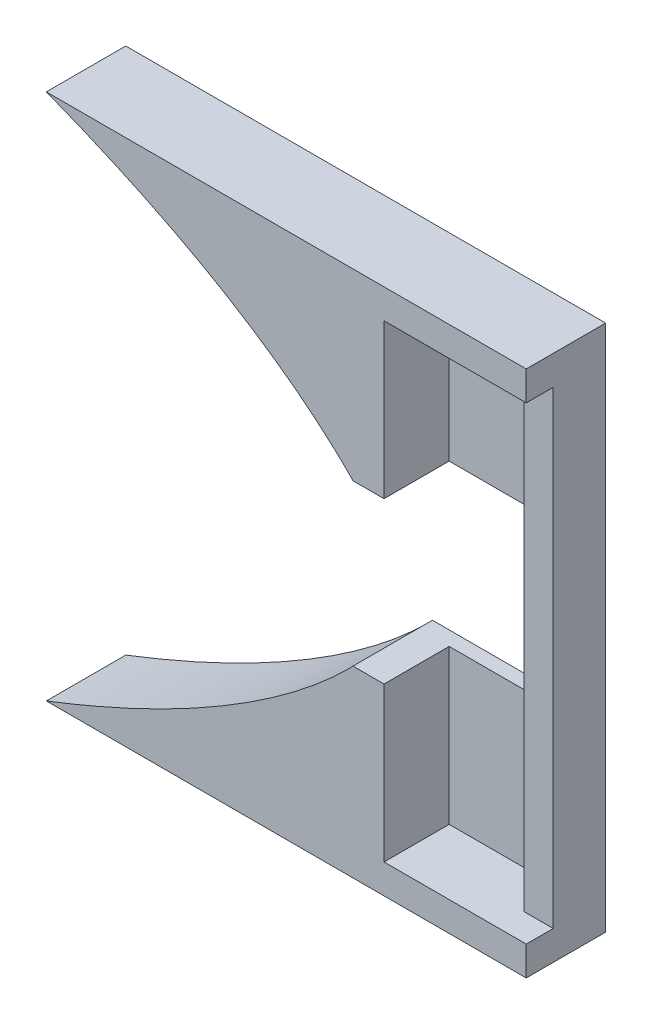
ISO-10303-21;
HEADER;
FILE_DESCRIPTION(('STEP AP214'),'2;1');
FILE_NAME('part.step','',(''),(''),'','','');
FILE_SCHEMA(('AUTOMOTIVE_DESIGN { 1 0 10303 214 1 1 1 1 }'));
ENDSEC;
DATA;
#1=APPLICATION_CONTEXT('core data for automotive mechanical design processes');
#2=APPLICATION_PROTOCOL_DEFINITION('international standard','automotive_design',2000,#1);
#3=PRODUCT_CONTEXT('',#1,'mechanical');
#4=PRODUCT('Part','Part','',(#3));
#5=PRODUCT_RELATED_PRODUCT_CATEGORY('part','',(#4));
#6=PRODUCT_DEFINITION_FORMATION('','',#4);
#7=PRODUCT_DEFINITION_CONTEXT('part definition',#1,'design');
#8=PRODUCT_DEFINITION('design','',#6,#7);
#9=PRODUCT_DEFINITION_SHAPE('','',#8);
#10=(LENGTH_UNIT() NAMED_UNIT(*) SI_UNIT(.MILLI.,.METRE.));
#11=(NAMED_UNIT(*) PLANE_ANGLE_UNIT() SI_UNIT($,.RADIAN.));
#12=(NAMED_UNIT(*) SI_UNIT($,.STERADIAN.) SOLID_ANGLE_UNIT());
#13=UNCERTAINTY_MEASURE_WITH_UNIT(LENGTH_MEASURE(1.E-05),#10,'distance_accuracy_value','');
#14=(GEOMETRIC_REPRESENTATION_CONTEXT(3) GLOBAL_UNCERTAINTY_ASSIGNED_CONTEXT((#13)) GLOBAL_UNIT_ASSIGNED_CONTEXT((#10,
#11,#12)) REPRESENTATION_CONTEXT('',''));
#15=CARTESIAN_POINT('',(0.,0.,0.));
#16=DIRECTION('',(0.,0.,1.));
#17=DIRECTION('',(1.,0.,0.));
#18=AXIS2_PLACEMENT_3D('',#15,#16,#17);
#19=CARTESIAN_POINT('',(0.,0.,0.));
#20=DIRECTION('',(0.,0.,1.));
#21=DIRECTION('',(1.,0.,0.));
#22=AXIS2_PLACEMENT_3D('',#19,#20,#21);
#23=PLANE('',#22);
#24=DIRECTION('',(0.,1.,0.));
#25=VECTOR('',#24,1.);
#26=CARTESIAN_POINT('',(64.8500000000002,0.,0.));
#27=LINE('',#26,#25);
#28=CARTESIAN_POINT('',(64.8500000000002,-14.7500000000006,0.));
#29=VERTEX_POINT('',#28);
#30=CARTESIAN_POINT('',(64.8500000000002,14.7499999999994,0.));
#31=VERTEX_POINT('',#30);
#32=EDGE_CURVE('E54',#29,#31,#27,.T.);
#33=ORIENTED_EDGE('',*,*,#32,.T.);
#34=DIRECTION('',(1.,0.,0.));
#35=VECTOR('',#34,1.);
#36=CARTESIAN_POINT('',(1.54964558399759E-13,14.75,0.));
#37=LINE('',#36,#35);
#38=CARTESIAN_POINT('',(63.0000000000002,14.7499999999993,0.));
#39=VERTEX_POINT('',#38);
#40=EDGE_CURVE('E199',#39,#31,#37,.T.);
#41=ORIENTED_EDGE('',*,*,#40,.F.);
#42=DIRECTION('',(0.,1.,0.));
#43=VECTOR('',#42,1.);
#44=CARTESIAN_POINT('',(63.,-6.81658119780446E-13,0.));
#45=LINE('',#44,#43);
#46=CARTESIAN_POINT('',(63.,-14.7500000000007,0.));
#47=VERTEX_POINT('',#46);
#48=EDGE_CURVE('E273',#47,#39,#45,.T.);
#49=ORIENTED_EDGE('',*,*,#48,.F.);
#50=DIRECTION('',(1.,0.,0.));
#51=VECTOR('',#50,1.);
#52=CARTESIAN_POINT('',(0.,-14.7500000000007,0.));
#53=LINE('',#52,#51);
#54=EDGE_CURVE('E12',#47,#29,#53,.T.);
#55=ORIENTED_EDGE('',*,*,#54,.T.);
#56=EDGE_LOOP('',(#33,#41,#49,#55));
#57=FACE_BOUND('',#56,.T.);
#58=ADVANCED_FACE('F37',(#57),#23,.T.);
#59=CARTESIAN_POINT('',(55.9,-5.99820880250125E-13,-3.3));
#60=DIRECTION('',(-1.,0.,0.));
#61=DIRECTION('',(0.,-1.,0.));
#62=AXIS2_PLACEMENT_3D('',#59,#60,#61);
#63=PLANE('',#62);
#64=DIRECTION('',(0.,1.,0.));
#65=VECTOR('',#64,1.);
#66=CARTESIAN_POINT('',(55.8999999999998,-14.7500000000006,-2.4));
#67=LINE('',#66,#65);
#68=CARTESIAN_POINT('',(55.8999999999998,-14.7500000000006,-2.4));
#69=VERTEX_POINT('',#68);
#70=CARTESIAN_POINT('',(55.8999999999998,-5.05000000000059,-2.4));
#71=VERTEX_POINT('',#70);
#72=EDGE_CURVE('E252',#69,#71,#67,.T.);
#73=ORIENTED_EDGE('',*,*,#72,.T.);
#74=DIRECTION('',(0.,0.,1.));
#75=VECTOR('',#74,1.);
#76=CARTESIAN_POINT('',(55.8999999999999,-5.05000000000059,-3.3));
#77=LINE('',#76,#75);
#78=CARTESIAN_POINT('',(55.8999999999999,-5.05000000000059,1.7));
#79=VERTEX_POINT('',#78);
#80=EDGE_CURVE('E389',#71,#79,#77,.T.);
#81=ORIENTED_EDGE('',*,*,#80,.T.);
#82=DIRECTION('',(0.,1.,0.));
#83=VECTOR('',#82,1.);
#84=CARTESIAN_POINT('',(55.9,-5.99820880250125E-13,1.7));
#85=LINE('',#84,#83);
#86=CARTESIAN_POINT('',(55.8999999999998,-14.7500000000006,1.7));
#87=VERTEX_POINT('',#86);
#88=EDGE_CURVE('E234',#87,#79,#85,.T.);
#89=ORIENTED_EDGE('',*,*,#88,.F.);
#90=DIRECTION('',(0.,0.,1.));
#91=VECTOR('',#90,1.);
#92=CARTESIAN_POINT('',(55.8999999999998,-14.7500000000006,-3.3));
#93=LINE('',#92,#91);
#94=EDGE_CURVE('E391',#69,#87,#93,.T.);
#95=ORIENTED_EDGE('',*,*,#94,.F.);
#96=EDGE_LOOP('',(#73,#81,#89,#95));
#97=FACE_BOUND('',#96,.T.);
#98=ADVANCED_FACE('F320',(#97),#63,.F.);
#99=CARTESIAN_POINT('',(-1.69379866157876E-13,-14.7499999999999,-3.3));
#100=DIRECTION('',(0.,-1.,0.));
#101=DIRECTION('',(1.,0.,0.));
#102=AXIS2_PLACEMENT_3D('',#99,#100,#101);
#103=PLANE('',#102);
#104=DIRECTION('',(-1.,0.,0.));
#105=VECTOR('',#104,1.);
#106=CARTESIAN_POINT('',(55.8999999999998,-14.7500000000006,-2.4));
#107=LINE('',#106,#105);
#108=CARTESIAN_POINT('',(63.,-14.7500000000006,-2.4));
#109=VERTEX_POINT('',#108);
#110=EDGE_CURVE('E261',#109,#69,#107,.T.);
#111=ORIENTED_EDGE('',*,*,#110,.T.);
#112=ORIENTED_EDGE('',*,*,#94,.T.);
#113=DIRECTION('',(1.,0.,0.));
#114=VECTOR('',#113,1.);
#115=CARTESIAN_POINT('',(0.,-14.7500000000007,1.7));
#116=LINE('',#115,#114);
#117=CARTESIAN_POINT('',(64.8500000000002,-14.7500000000007,1.7));
#118=VERTEX_POINT('',#117);
#119=EDGE_CURVE('E193',#87,#118,#116,.T.);
#120=ORIENTED_EDGE('',*,*,#119,.T.);
#121=DIRECTION('',(0.,0.,-1.));
#122=VECTOR('',#121,1.);
#123=CARTESIAN_POINT('',(64.8500000000002,-14.7500000000007,39.0381002635323));
#124=LINE('',#123,#122);
#125=EDGE_CURVE('E62',#118,#29,#124,.T.);
#126=ORIENTED_EDGE('',*,*,#125,.T.);
#127=ORIENTED_EDGE('',*,*,#54,.F.);
#128=DIRECTION('',(0.,0.,1.));
#129=VECTOR('',#128,1.);
#130=CARTESIAN_POINT('',(62.9999999999999,-14.7500000000007,-3.3));
#131=LINE('',#130,#129);
#132=EDGE_CURVE('E393',#109,#47,#131,.T.);
#133=ORIENTED_EDGE('',*,*,#132,.F.);
#134=EDGE_LOOP('',(#111,#112,#120,#126,#127,#133));
#135=FACE_BOUND('',#134,.T.);
#136=ADVANCED_FACE('F325',(#135),#103,.F.);
#137=CARTESIAN_POINT('',(0.,-24.,-3.3));
#138=CARTESIAN_POINT('',(10.9049465601111,-24.,-3.3));
#139=CARTESIAN_POINT('',(40.8426434536443,-18.1639582641541,-3.3));
#140=CARTESIAN_POINT('',(53.7033008588991,-5.30330085889908,-3.3));
#141=B_SPLINE_CURVE_WITH_KNOTS('',3,(#137,#138,#139,#140),.UNSPECIFIED.,.F.,.F.,(4,4),(0.,1.),.UNSPECIFIED.);
#142=DIRECTION('',(0.,0.,1.));
#143=VECTOR('',#142,1.);
#144=SURFACE_OF_LINEAR_EXTRUSION('',#141,#143);
#145=DIRECTION('',(0.,0.,1.));
#146=VECTOR('',#145,1.);
#147=CARTESIAN_POINT('',(34.6448642006982,-16.5999999999993,-3.3));
#148=LINE('',#147,#146);
#149=CARTESIAN_POINT('',(34.6448642006982,-16.5999999999993,-3.3));
#150=VERTEX_POINT('',#149);
#151=CARTESIAN_POINT('',(34.6448642006982,-16.5999999999993,1.7));
#152=VERTEX_POINT('',#151);
#153=EDGE_CURVE('E42',#150,#152,#148,.T.);
#154=ORIENTED_EDGE('',*,*,#153,.T.);
#155=CARTESIAN_POINT('',(53.7033008588991,-5.30330085889908,1.7));
#156=CARTESIAN_POINT('',(40.8426434536443,-18.1639582641541,1.7));
#157=CARTESIAN_POINT('',(10.9049465601111,-24.,1.7));
#158=CARTESIAN_POINT('',(0.,-24.,1.7));
#159=B_SPLINE_CURVE_WITH_KNOTS('',3,(#155,#156,#157,#158),.UNSPECIFIED.,.F.,.F.,(4,4),(0.,1.),.UNSPECIFIED.);
#160=CARTESIAN_POINT('',(53.7033008588991,-5.30330085889908,1.7));
#161=VERTEX_POINT('',#160);
#162=EDGE_CURVE('E220',#161,#152,#159,.T.);
#163=ORIENTED_EDGE('',*,*,#162,.F.);
#164=DIRECTION('',(0.,0.,1.));
#165=VECTOR('',#164,1.);
#166=CARTESIAN_POINT('',(53.7033008588991,-5.30330085889908,-3.3));
#167=LINE('',#166,#165);
#168=CARTESIAN_POINT('',(53.7033008588991,-5.30330085889908,-3.3));
#169=VERTEX_POINT('',#168);
#170=EDGE_CURVE('E47',#169,#161,#167,.T.);
#171=ORIENTED_EDGE('',*,*,#170,.F.);
#172=EDGE_CURVE('E266',#150,#169,#141,.T.);
#173=ORIENTED_EDGE('',*,*,#172,.F.);
#174=EDGE_LOOP('',(#154,#163,#171,#173));
#175=FACE_BOUND('',#174,.T.);
#176=ADVANCED_FACE('F39',(#175),#144,.F.);
#177=CARTESIAN_POINT('',(48.4,0.,-3.3));
#178=DIRECTION('',(0.,0.,1.));
#179=DIRECTION('',(1.,0.,0.));
#180=AXIS2_PLACEMENT_3D('',#177,#178,#179);
#181=CYLINDRICAL_SURFACE('',#180,7.5);
#182=ORIENTED_EDGE('',*,*,#170,.T.);
#183=CARTESIAN_POINT('',(48.4,0.,1.7));
#184=DIRECTION('',(0.,0.,1.));
#185=DIRECTION('',(1.,0.,0.));
#186=AXIS2_PLACEMENT_3D('',#183,#184,#185);
#187=CIRCLE('',#186,7.5);
#188=CARTESIAN_POINT('',(53.9450428312136,-5.05000000000064,1.7));
#189=VERTEX_POINT('',#188);
#190=EDGE_CURVE('E225',#189,#161,#187,.F.);
#191=ORIENTED_EDGE('',*,*,#190,.F.);
#192=DIRECTION('',(0.,0.,1.));
#193=VECTOR('',#192,1.);
#194=CARTESIAN_POINT('',(53.9450428312136,-5.05000000000064,-3.3));
#195=LINE('',#194,#193);
#196=CARTESIAN_POINT('',(53.9450428312136,-5.05000000000064,-3.3));
#197=VERTEX_POINT('',#196);
#198=EDGE_CURVE('E387',#197,#189,#195,.T.);
#199=ORIENTED_EDGE('',*,*,#198,.F.);
#200=CARTESIAN_POINT('',(48.4,0.,-3.3));
#201=DIRECTION('',(0.,0.,1.));
#202=DIRECTION('',(1.,0.,0.));
#203=AXIS2_PLACEMENT_3D('',#200,#201,#202);
#204=CIRCLE('',#203,7.5);
#205=EDGE_CURVE('E370',#169,#197,#204,.T.);
#206=ORIENTED_EDGE('',*,*,#205,.F.);
#207=EDGE_LOOP('',(#182,#191,#199,#206));
#208=FACE_BOUND('',#207,.T.);
#209=ADVANCED_FACE('F330',(#208),#181,.F.);
#210=CARTESIAN_POINT('',(1.25470728167153E-13,-5.05000000000198,-3.3));
#211=DIRECTION('',(0.,1.,0.));
#212=DIRECTION('',(-1.,0.,0.));
#213=AXIS2_PLACEMENT_3D('',#210,#211,#212);
#214=PLANE('',#213);
#215=ORIENTED_EDGE('',*,*,#198,.T.);
#216=DIRECTION('',(-1.,0.,0.));
#217=VECTOR('',#216,1.);
#218=CARTESIAN_POINT('',(1.25470728167153E-13,-5.05000000000198,1.7));
#219=LINE('',#218,#217);
#220=EDGE_CURVE('E231',#79,#189,#219,.T.);
#221=ORIENTED_EDGE('',*,*,#220,.F.);
#222=ORIENTED_EDGE('',*,*,#80,.F.);
#223=DIRECTION('',(1.,0.,0.));
#224=VECTOR('',#223,1.);
#225=CARTESIAN_POINT('',(55.8999999999998,-5.05000000000059,-2.4));
#226=LINE('',#225,#224);
#227=CARTESIAN_POINT('',(62.9999999999999,-5.05000000000059,-2.4));
#228=VERTEX_POINT('',#227);
#229=EDGE_CURVE('E255',#71,#228,#226,.T.);
#230=ORIENTED_EDGE('',*,*,#229,.T.);
#231=DIRECTION('',(0.,0.,-1.));
#232=VECTOR('',#231,1.);
#233=CARTESIAN_POINT('',(62.9999999999999,-5.05000000000059,-2.4));
#234=LINE('',#233,#232);
#235=CARTESIAN_POINT('',(63.,-5.05000000000059,-3.3));
#236=VERTEX_POINT('',#235);
#237=EDGE_CURVE('E264',#228,#236,#234,.T.);
#238=ORIENTED_EDGE('',*,*,#237,.T.);
#239=DIRECTION('',(-1.,0.,0.));
#240=VECTOR('',#239,1.);
#241=CARTESIAN_POINT('',(1.25470728167153E-13,-5.05000000000198,-3.3));
#242=LINE('',#241,#240);
#243=EDGE_CURVE('E374',#236,#197,#242,.T.);
#244=ORIENTED_EDGE('',*,*,#243,.T.);
#245=EDGE_LOOP('',(#215,#221,#222,#230,#238,#244));
#246=FACE_BOUND('',#245,.T.);
#247=ADVANCED_FACE('F333',(#246),#214,.T.);
#248=CARTESIAN_POINT('',(63.,-6.81658119780446E-13,-3.3));
#249=DIRECTION('',(1.,0.,0.));
#250=DIRECTION('',(0.,1.,0.));
#251=AXIS2_PLACEMENT_3D('',#248,#249,#250);
#252=PLANE('',#251);
#253=DIRECTION('',(0.,-1.,0.));
#254=VECTOR('',#253,1.);
#255=CARTESIAN_POINT('',(63.0000000000001,14.7499999999994,-2.4));
#256=LINE('',#255,#254);
#257=CARTESIAN_POINT('',(63.0000000000001,14.7499999999994,-2.4));
#258=VERTEX_POINT('',#257);
#259=CARTESIAN_POINT('',(62.9999999999999,5.04999999999941,-2.4));
#260=VERTEX_POINT('',#259);
#261=EDGE_CURVE('E245',#258,#260,#256,.T.);
#262=ORIENTED_EDGE('',*,*,#261,.T.);
#263=DIRECTION('',(0.,0.,-1.));
#264=VECTOR('',#263,1.);
#265=CARTESIAN_POINT('',(62.9999999999999,5.04999999999941,-2.4));
#266=LINE('',#265,#264);
#267=CARTESIAN_POINT('',(62.9999999999999,5.04999999999941,-3.3));
#268=VERTEX_POINT('',#267);
#269=EDGE_CURVE('E249',#260,#268,#266,.T.);
#270=ORIENTED_EDGE('',*,*,#269,.T.);
#271=DIRECTION('',(0.,1.,0.));
#272=VECTOR('',#271,1.);
#273=CARTESIAN_POINT('',(63.,-6.81658119780446E-13,-3.3));
#274=LINE('',#273,#272);
#275=EDGE_CURVE('E377',#236,#268,#274,.T.);
#276=ORIENTED_EDGE('',*,*,#275,.F.);
#277=ORIENTED_EDGE('',*,*,#237,.F.);
#278=DIRECTION('',(0.,-1.,0.));
#279=VECTOR('',#278,1.);
#280=CARTESIAN_POINT('',(63.,-14.7500000000006,-2.4));
#281=LINE('',#280,#279);
#282=EDGE_CURVE('E258',#228,#109,#281,.T.);
#283=ORIENTED_EDGE('',*,*,#282,.T.);
#284=ORIENTED_EDGE('',*,*,#132,.T.);
#285=ORIENTED_EDGE('',*,*,#48,.T.);
#286=DIRECTION('',(0.,0.,1.));
#287=VECTOR('',#286,1.);
#288=CARTESIAN_POINT('',(63.0000000000002,14.7499999999993,-3.3));
#289=LINE('',#288,#287);
#290=EDGE_CURVE('E396',#258,#39,#289,.T.);
#291=ORIENTED_EDGE('',*,*,#290,.F.);
#292=EDGE_LOOP('',(#262,#270,#276,#277,#283,#284,#285,#291));
#293=FACE_BOUND('',#292,.T.);
#294=ADVANCED_FACE('F336',(#293),#252,.F.);
#295=CARTESIAN_POINT('',(1.54964558399759E-13,14.75,-3.3));
#296=DIRECTION('',(0.,1.,0.));
#297=DIRECTION('',(-1.,0.,0.));
#298=AXIS2_PLACEMENT_3D('',#295,#296,#297);
#299=PLANE('',#298);
#300=DIRECTION('',(0.,0.,1.));
#301=VECTOR('',#300,1.);
#302=CARTESIAN_POINT('',(55.9000000000002,14.7499999999994,-3.3));
#303=LINE('',#302,#301);
#304=CARTESIAN_POINT('',(55.9000000000002,14.7499999999994,-2.4));
#305=VERTEX_POINT('',#304);
#306=CARTESIAN_POINT('',(55.9000000000002,14.7499999999994,1.7));
#307=VERTEX_POINT('',#306);
#308=EDGE_CURVE('E176',#305,#307,#303,.T.);
#309=ORIENTED_EDGE('',*,*,#308,.F.);
#310=DIRECTION('',(1.,0.,0.));
#311=VECTOR('',#310,1.);
#312=CARTESIAN_POINT('',(55.9000000000002,14.7499999999994,-2.4));
#313=LINE('',#312,#311);
#314=EDGE_CURVE('E242',#305,#258,#313,.T.);
#315=ORIENTED_EDGE('',*,*,#314,.T.);
#316=ORIENTED_EDGE('',*,*,#290,.T.);
#317=ORIENTED_EDGE('',*,*,#40,.T.);
#318=DIRECTION('',(0.,0.,-1.));
#319=VECTOR('',#318,1.);
#320=CARTESIAN_POINT('',(64.8500000000002,14.7499999999993,39.0381002635323));
#321=LINE('',#320,#319);
#322=CARTESIAN_POINT('',(64.8500000000002,14.7499999999993,1.7));
#323=VERTEX_POINT('',#322);
#324=EDGE_CURVE('E187',#323,#31,#321,.T.);
#325=ORIENTED_EDGE('',*,*,#324,.F.);
#326=DIRECTION('',(1.,0.,0.));
#327=VECTOR('',#326,1.);
#328=CARTESIAN_POINT('',(1.54964558399759E-13,14.75,1.7));
#329=LINE('',#328,#327);
#330=EDGE_CURVE('E186',#307,#323,#329,.T.);
#331=ORIENTED_EDGE('',*,*,#330,.F.);
#332=EDGE_LOOP('',(#309,#315,#316,#317,#325,#331));
#333=FACE_BOUND('',#332,.T.);
#334=ADVANCED_FACE('F343',(#333),#299,.F.);
#335=CARTESIAN_POINT('',(55.9,-5.99820880250125E-13,-3.3));
#336=DIRECTION('',(-1.,0.,0.));
#337=DIRECTION('',(0.,-1.,0.));
#338=AXIS2_PLACEMENT_3D('',#335,#336,#337);
#339=PLANE('',#338);
#340=DIRECTION('',(0.,0.,1.));
#341=VECTOR('',#340,1.);
#342=CARTESIAN_POINT('',(55.9000000000001,5.04999999999941,-3.3));
#343=LINE('',#342,#341);
#344=CARTESIAN_POINT('',(55.9000000000002,5.04999999999941,-2.4));
#345=VERTEX_POINT('',#344);
#346=CARTESIAN_POINT('',(55.9000000000001,5.04999999999941,1.7));
#347=VERTEX_POINT('',#346);
#348=EDGE_CURVE('E165',#345,#347,#343,.T.);
#349=ORIENTED_EDGE('',*,*,#348,.F.);
#350=DIRECTION('',(0.,1.,0.));
#351=VECTOR('',#350,1.);
#352=CARTESIAN_POINT('',(55.9000000000002,14.7499999999994,-2.4));
#353=LINE('',#352,#351);
#354=EDGE_CURVE('E239',#345,#305,#353,.T.);
#355=ORIENTED_EDGE('',*,*,#354,.T.);
#356=ORIENTED_EDGE('',*,*,#308,.T.);
#357=DIRECTION('',(0.,1.,0.));
#358=VECTOR('',#357,1.);
#359=CARTESIAN_POINT('',(55.9,-5.99820880250125E-13,1.7));
#360=LINE('',#359,#358);
#361=EDGE_CURVE('E180',#347,#307,#360,.T.);
#362=ORIENTED_EDGE('',*,*,#361,.F.);
#363=EDGE_LOOP('',(#349,#355,#356,#362));
#364=FACE_BOUND('',#363,.T.);
#365=ADVANCED_FACE('F181',(#364),#339,.F.);
#366=CARTESIAN_POINT('',(0.,5.04999999999941,-3.3));
#367=DIRECTION('',(0.,1.,0.));
#368=DIRECTION('',(0.,0.,1.));
#369=AXIS2_PLACEMENT_3D('',#366,#367,#368);
#370=PLANE('',#369);
#371=ORIENTED_EDGE('',*,*,#348,.T.);
#372=DIRECTION('',(1.,0.,0.));
#373=VECTOR('',#372,1.);
#374=CARTESIAN_POINT('',(0.,5.04999999999941,1.7));
#375=LINE('',#374,#373);
#376=CARTESIAN_POINT('',(53.9450428312136,5.04999999999941,1.7));
#377=VERTEX_POINT('',#376);
#378=EDGE_CURVE('E170',#377,#347,#375,.T.);
#379=ORIENTED_EDGE('',*,*,#378,.F.);
#380=DIRECTION('',(0.,0.,1.));
#381=VECTOR('',#380,1.);
#382=CARTESIAN_POINT('',(53.9450428312136,5.04999999999941,-3.3));
#383=LINE('',#382,#381);
#384=CARTESIAN_POINT('',(53.9450428312136,5.04999999999941,-3.3));
#385=VERTEX_POINT('',#384);
#386=EDGE_CURVE('E177',#385,#377,#383,.T.);
#387=ORIENTED_EDGE('',*,*,#386,.F.);
#388=DIRECTION('',(-1.,0.,0.));
#389=VECTOR('',#388,1.);
#390=CARTESIAN_POINT('',(0.,5.04999999999941,-3.3));
#391=LINE('',#390,#389);
#392=EDGE_CURVE('E379',#268,#385,#391,.T.);
#393=ORIENTED_EDGE('',*,*,#392,.F.);
#394=ORIENTED_EDGE('',*,*,#269,.F.);
#395=DIRECTION('',(-1.,0.,0.));
#396=VECTOR('',#395,1.);
#397=CARTESIAN_POINT('',(55.9000000000002,5.04999999999941,-2.4));
#398=LINE('',#397,#396);
#399=EDGE_CURVE('E173',#260,#345,#398,.T.);
#400=ORIENTED_EDGE('',*,*,#399,.T.);
#401=EDGE_LOOP('',(#371,#379,#387,#393,#394,#400));
#402=FACE_BOUND('',#401,.T.);
#403=ADVANCED_FACE('F167',(#402),#370,.F.);
#404=ORIENTED_EDGE('',*,*,#386,.T.);
#405=CARTESIAN_POINT('',(48.4,0.,1.7));
#406=DIRECTION('',(0.,0.,1.));
#407=DIRECTION('',(1.,0.,0.));
#408=AXIS2_PLACEMENT_3D('',#405,#406,#407);
#409=CIRCLE('',#408,7.5);
#410=CARTESIAN_POINT('',(53.7033008588991,5.30330085889908,1.7));
#411=VERTEX_POINT('',#410);
#412=EDGE_CURVE('E192',#411,#377,#409,.F.);
#413=ORIENTED_EDGE('',*,*,#412,.F.);
#414=DIRECTION('',(0.,0.,1.));
#415=VECTOR('',#414,1.);
#416=CARTESIAN_POINT('',(53.7033008588991,5.30330085889908,-3.3));
#417=LINE('',#416,#415);
#418=CARTESIAN_POINT('',(53.7033008588991,5.30330085889908,-3.3));
#419=VERTEX_POINT('',#418);
#420=EDGE_CURVE('E359',#419,#411,#417,.T.);
#421=ORIENTED_EDGE('',*,*,#420,.F.);
#422=EDGE_CURVE('E289',#385,#419,#204,.T.);
#423=ORIENTED_EDGE('',*,*,#422,.F.);
#424=EDGE_LOOP('',(#404,#413,#421,#423));
#425=FACE_BOUND('',#424,.T.);
#426=ADVANCED_FACE('F300',(#425),#181,.F.);
#427=CARTESIAN_POINT('',(53.7033008588991,5.30330085889908,-3.3));
#428=CARTESIAN_POINT('',(40.8426434536443,18.1639582641541,-3.3));
#429=CARTESIAN_POINT('',(10.9049465601111,24.,-3.3));
#430=CARTESIAN_POINT('',(0.,24.,-3.3));
#431=B_SPLINE_CURVE_WITH_KNOTS('',3,(#427,#428,#429,#430),.UNSPECIFIED.,.F.,.F.,(4,4),(0.,1.),.UNSPECIFIED.);
#432=DIRECTION('',(0.,0.,1.));
#433=VECTOR('',#432,1.);
#434=SURFACE_OF_LINEAR_EXTRUSION('',#431,#433);
#435=ORIENTED_EDGE('',*,*,#420,.T.);
#436=CARTESIAN_POINT('',(0.,24.,1.7));
#437=CARTESIAN_POINT('',(10.9049465601111,24.,1.7));
#438=CARTESIAN_POINT('',(40.8426434536443,18.1639582641541,1.7));
#439=CARTESIAN_POINT('',(53.7033008588991,5.30330085889908,1.7));
#440=B_SPLINE_CURVE_WITH_KNOTS('',3,(#436,#437,#438,#439),.UNSPECIFIED.,.F.,.F.,(4,4),(0.,1.),.UNSPECIFIED.);
#441=CARTESIAN_POINT('',(34.6448642006982,16.5999999999993,1.7));
#442=VERTEX_POINT('',#441);
#443=EDGE_CURVE('E196',#442,#411,#440,.T.);
#444=ORIENTED_EDGE('',*,*,#443,.F.);
#445=DIRECTION('',(0.,0.,1.));
#446=VECTOR('',#445,1.);
#447=CARTESIAN_POINT('',(34.6448642006982,16.5999999999993,-3.3));
#448=LINE('',#447,#446);
#449=CARTESIAN_POINT('',(34.6448642006982,16.5999999999993,-3.3));
#450=VERTEX_POINT('',#449);
#451=EDGE_CURVE('E361',#450,#442,#448,.T.);
#452=ORIENTED_EDGE('',*,*,#451,.F.);
#453=EDGE_CURVE('E284',#419,#450,#431,.T.);
#454=ORIENTED_EDGE('',*,*,#453,.F.);
#455=EDGE_LOOP('',(#435,#444,#452,#454));
#456=FACE_BOUND('',#455,.T.);
#457=ADVANCED_FACE('F295',(#456),#434,.F.);
#458=CARTESIAN_POINT('',(0.,16.5999999999993,-3.3));
#459=DIRECTION('',(0.,-1.,0.));
#460=DIRECTION('',(0.,0.,-1.));
#461=AXIS2_PLACEMENT_3D('',#458,#459,#460);
#462=PLANE('',#461);
#463=ORIENTED_EDGE('',*,*,#451,.T.);
#464=DIRECTION('',(-1.,0.,0.));
#465=VECTOR('',#464,1.);
#466=CARTESIAN_POINT('',(0.,16.5999999999993,1.7));
#467=LINE('',#466,#465);
#468=CARTESIAN_POINT('',(64.8500000000002,16.5999999999993,1.7));
#469=VERTEX_POINT('',#468);
#470=EDGE_CURVE('E204',#469,#442,#467,.T.);
#471=ORIENTED_EDGE('',*,*,#470,.F.);
#472=DIRECTION('',(0.,0.,1.));
#473=VECTOR('',#472,1.);
#474=CARTESIAN_POINT('',(64.8500000000002,16.5999999999993,-3.3));
#475=LINE('',#474,#473);
#476=CARTESIAN_POINT('',(64.8500000000002,16.5999999999993,-3.3));
#477=VERTEX_POINT('',#476);
#478=EDGE_CURVE('E366',#477,#469,#475,.T.);
#479=ORIENTED_EDGE('',*,*,#478,.F.);
#480=DIRECTION('',(1.,0.,0.));
#481=VECTOR('',#480,1.);
#482=CARTESIAN_POINT('',(0.,16.5999999999993,-3.3));
#483=LINE('',#482,#481);
#484=EDGE_CURVE('E282',#450,#477,#483,.T.);
#485=ORIENTED_EDGE('',*,*,#484,.F.);
#486=EDGE_LOOP('',(#463,#471,#479,#485));
#487=FACE_BOUND('',#486,.T.);
#488=ADVANCED_FACE('F299',(#487),#462,.F.);
#489=CARTESIAN_POINT('',(64.8500000000002,0.,-3.3));
#490=DIRECTION('',(1.,0.,0.));
#491=DIRECTION('',(0.,0.,-1.));
#492=AXIS2_PLACEMENT_3D('',#489,#490,#491);
#493=PLANE('',#492);
#494=ORIENTED_EDGE('',*,*,#32,.F.);
#495=ORIENTED_EDGE('',*,*,#125,.F.);
#496=DIRECTION('',(0.,1.,0.));
#497=VECTOR('',#496,1.);
#498=CARTESIAN_POINT('',(64.8500000000002,0.,1.7));
#499=LINE('',#498,#497);
#500=CARTESIAN_POINT('',(64.8500000000002,-16.5999999999993,1.7));
#501=VERTEX_POINT('',#500);
#502=EDGE_CURVE('E219',#501,#118,#499,.T.);
#503=ORIENTED_EDGE('',*,*,#502,.F.);
#504=DIRECTION('',(0.,0.,1.));
#505=VECTOR('',#504,1.);
#506=CARTESIAN_POINT('',(64.8500000000002,-16.5999999999993,-3.3));
#507=LINE('',#506,#505);
#508=CARTESIAN_POINT('',(64.8500000000002,-16.5999999999993,-3.3));
#509=VERTEX_POINT('',#508);
#510=EDGE_CURVE('E367',#509,#501,#507,.T.);
#511=ORIENTED_EDGE('',*,*,#510,.F.);
#512=DIRECTION('',(0.,1.,0.));
#513=VECTOR('',#512,1.);
#514=CARTESIAN_POINT('',(64.8500000000002,0.,-3.3));
#515=LINE('',#514,#513);
#516=EDGE_CURVE('E279',#509,#477,#515,.T.);
#517=ORIENTED_EDGE('',*,*,#516,.T.);
#518=ORIENTED_EDGE('',*,*,#478,.T.);
#519=DIRECTION('',(0.,1.,0.));
#520=VECTOR('',#519,1.);
#521=CARTESIAN_POINT('',(64.8500000000002,0.,1.7));
#522=LINE('',#521,#520);
#523=EDGE_CURVE('E210',#323,#469,#522,.T.);
#524=ORIENTED_EDGE('',*,*,#523,.F.);
#525=ORIENTED_EDGE('',*,*,#324,.T.);
#526=EDGE_LOOP('',(#494,#495,#503,#511,#517,#518,#524,#525));
#527=FACE_BOUND('',#526,.T.);
#528=ADVANCED_FACE('F305',(#527),#493,.T.);
#529=CARTESIAN_POINT('',(0.,-16.5999999999993,-3.3));
#530=DIRECTION('',(0.,-1.,0.));
#531=DIRECTION('',(0.,0.,-1.));
#532=AXIS2_PLACEMENT_3D('',#529,#530,#531);
#533=PLANE('',#532);
#534=ORIENTED_EDGE('',*,*,#510,.T.);
#535=DIRECTION('',(1.,0.,0.));
#536=VECTOR('',#535,1.);
#537=CARTESIAN_POINT('',(0.,-16.5999999999993,1.7));
#538=LINE('',#537,#536);
#539=EDGE_CURVE('E216',#152,#501,#538,.T.);
#540=ORIENTED_EDGE('',*,*,#539,.F.);
#541=ORIENTED_EDGE('',*,*,#153,.F.);
#542=DIRECTION('',(1.,0.,0.));
#543=VECTOR('',#542,1.);
#544=CARTESIAN_POINT('',(0.,-16.5999999999993,-3.3));
#545=LINE('',#544,#543);
#546=EDGE_CURVE('E272',#150,#509,#545,.T.);
#547=ORIENTED_EDGE('',*,*,#546,.T.);
#548=EDGE_LOOP('',(#534,#540,#541,#547));
#549=FACE_BOUND('',#548,.T.);
#550=ADVANCED_FACE('F308',(#549),#533,.T.);
#551=CARTESIAN_POINT('',(0.,0.,-3.3));
#552=DIRECTION('',(0.,0.,1.));
#553=DIRECTION('',(1.,0.,0.));
#554=AXIS2_PLACEMENT_3D('',#551,#552,#553);
#555=PLANE('',#554);
#556=ORIENTED_EDGE('',*,*,#275,.T.);
#557=ORIENTED_EDGE('',*,*,#392,.T.);
#558=ORIENTED_EDGE('',*,*,#422,.T.);
#559=ORIENTED_EDGE('',*,*,#453,.T.);
#560=ORIENTED_EDGE('',*,*,#484,.T.);
#561=ORIENTED_EDGE('',*,*,#516,.F.);
#562=ORIENTED_EDGE('',*,*,#546,.F.);
#563=ORIENTED_EDGE('',*,*,#172,.T.);
#564=ORIENTED_EDGE('',*,*,#205,.T.);
#565=ORIENTED_EDGE('',*,*,#243,.F.);
#566=EDGE_LOOP('',(#556,#557,#558,#559,#560,#561,#562,#563,#564,#565));
#567=FACE_BOUND('',#566,.T.);
#568=ADVANCED_FACE('F311',(#567),#555,.F.);
#569=CARTESIAN_POINT('',(0.,0.,-2.4));
#570=DIRECTION('',(0.,0.,-1.));
#571=DIRECTION('',(-1.,0.,0.));
#572=AXIS2_PLACEMENT_3D('',#569,#570,#571);
#573=PLANE('',#572);
#574=ORIENTED_EDGE('',*,*,#72,.F.);
#575=ORIENTED_EDGE('',*,*,#110,.F.);
#576=ORIENTED_EDGE('',*,*,#282,.F.);
#577=ORIENTED_EDGE('',*,*,#229,.F.);
#578=EDGE_LOOP('',(#574,#575,#576,#577));
#579=FACE_BOUND('',#578,.T.);
#580=ADVANCED_FACE('F316',(#579),#573,.F.);
#581=CARTESIAN_POINT('',(0.,0.,-2.4));
#582=DIRECTION('',(0.,0.,1.));
#583=DIRECTION('',(1.,0.,0.));
#584=AXIS2_PLACEMENT_3D('',#581,#582,#583);
#585=PLANE('',#584);
#586=ORIENTED_EDGE('',*,*,#354,.F.);
#587=ORIENTED_EDGE('',*,*,#399,.F.);
#588=ORIENTED_EDGE('',*,*,#261,.F.);
#589=ORIENTED_EDGE('',*,*,#314,.F.);
#590=EDGE_LOOP('',(#586,#587,#588,#589));
#591=FACE_BOUND('',#590,.T.);
#592=ADVANCED_FACE('F416',(#591),#585,.T.);
#593=CARTESIAN_POINT('',(0.,0.,1.7));
#594=DIRECTION('',(0.,0.,1.));
#595=DIRECTION('',(1.,0.,0.));
#596=AXIS2_PLACEMENT_3D('',#593,#594,#595);
#597=PLANE('',#596);
#598=ORIENTED_EDGE('',*,*,#119,.F.);
#599=ORIENTED_EDGE('',*,*,#88,.T.);
#600=ORIENTED_EDGE('',*,*,#220,.T.);
#601=ORIENTED_EDGE('',*,*,#190,.T.);
#602=ORIENTED_EDGE('',*,*,#162,.T.);
#603=ORIENTED_EDGE('',*,*,#539,.T.);
#604=ORIENTED_EDGE('',*,*,#502,.T.);
#605=EDGE_LOOP('',(#598,#599,#600,#601,#602,#603,#604));
#606=FACE_BOUND('',#605,.T.);
#607=ADVANCED_FACE('F418',(#606),#597,.T.);
#608=CARTESIAN_POINT('',(0.,0.,1.7));
#609=DIRECTION('',(0.,0.,1.));
#610=DIRECTION('',(1.,0.,0.));
#611=AXIS2_PLACEMENT_3D('',#608,#609,#610);
#612=PLANE('',#611);
#613=ORIENTED_EDGE('',*,*,#361,.T.);
#614=ORIENTED_EDGE('',*,*,#330,.T.);
#615=ORIENTED_EDGE('',*,*,#523,.T.);
#616=ORIENTED_EDGE('',*,*,#470,.T.);
#617=ORIENTED_EDGE('',*,*,#443,.T.);
#618=ORIENTED_EDGE('',*,*,#412,.T.);
#619=ORIENTED_EDGE('',*,*,#378,.T.);
#620=EDGE_LOOP('',(#613,#614,#615,#616,#617,#618,#619));
#621=FACE_BOUND('',#620,.T.);
#622=ADVANCED_FACE('F189',(#621),#612,.T.);
#623=CLOSED_SHELL('',(#58,#98,#136,#176,#209,#247,#294,#334,#365,#403,#426,#457,#488,#528,#550,
#568,#580,#592,#607,#622));
#624=MANIFOLD_SOLID_BREP('B2',#623);
#625=ADVANCED_BREP_SHAPE_REPRESENTATION('',(#18,#624),#14);
#626=SHAPE_DEFINITION_REPRESENTATION(#9,#625);
ENDSEC;
END-ISO-10303-21;
